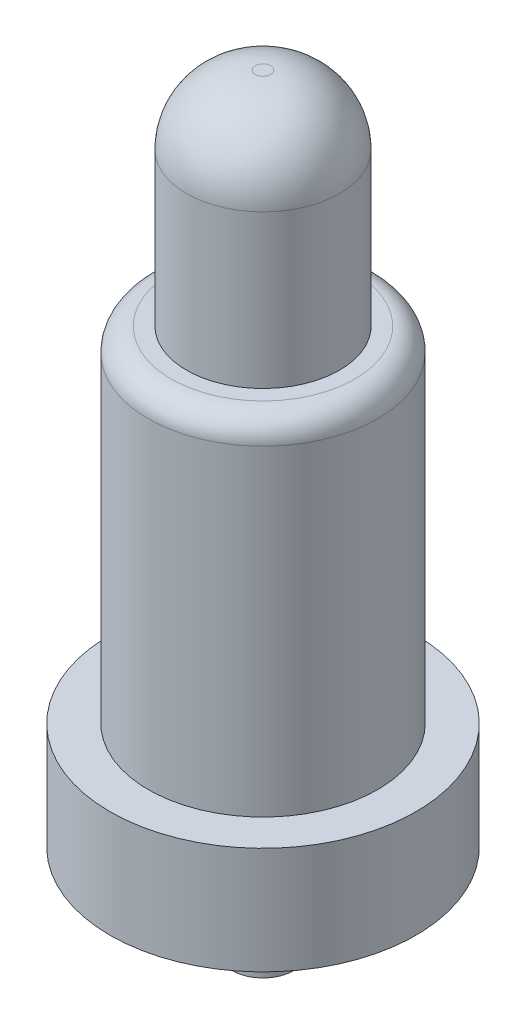
ISO-10303-21;
HEADER;
FILE_DESCRIPTION(('STEP AP214'),'2;1');
FILE_NAME('part.step','',(''),(''),'','','');
FILE_SCHEMA(('AUTOMOTIVE_DESIGN { 1 0 10303 214 1 1 1 1 }'));
ENDSEC;
DATA;
#1=APPLICATION_CONTEXT('core data for automotive mechanical design processes');
#2=APPLICATION_PROTOCOL_DEFINITION('international standard','automotive_design',2000,#1);
#3=PRODUCT_CONTEXT('',#1,'mechanical');
#4=PRODUCT('Part','Part','',(#3));
#5=PRODUCT_RELATED_PRODUCT_CATEGORY('part','',(#4));
#6=PRODUCT_DEFINITION_FORMATION('','',#4);
#7=PRODUCT_DEFINITION_CONTEXT('part definition',#1,'design');
#8=PRODUCT_DEFINITION('design','',#6,#7);
#9=PRODUCT_DEFINITION_SHAPE('','',#8);
#10=(LENGTH_UNIT() NAMED_UNIT(*) SI_UNIT(.MILLI.,.METRE.));
#11=(NAMED_UNIT(*) PLANE_ANGLE_UNIT() SI_UNIT($,.RADIAN.));
#12=(NAMED_UNIT(*) SI_UNIT($,.STERADIAN.) SOLID_ANGLE_UNIT());
#13=UNCERTAINTY_MEASURE_WITH_UNIT(LENGTH_MEASURE(1.E-05),#10,'distance_accuracy_value','');
#14=(GEOMETRIC_REPRESENTATION_CONTEXT(3) GLOBAL_UNCERTAINTY_ASSIGNED_CONTEXT((#13)) GLOBAL_UNIT_ASSIGNED_CONTEXT((#10,
#11,#12)) REPRESENTATION_CONTEXT('',''));
#15=CARTESIAN_POINT('',(0.,0.,0.));
#16=DIRECTION('',(0.,0.,1.));
#17=DIRECTION('',(1.,0.,0.));
#18=AXIS2_PLACEMENT_3D('',#15,#16,#17);
#19=CARTESIAN_POINT('',(0.,0.,0.));
#20=DIRECTION('',(0.,1.,0.));
#21=DIRECTION('',(0.,0.,1.));
#22=AXIS2_PLACEMENT_3D('',#19,#20,#21);
#23=PLANE('',#22);
#24=CARTESIAN_POINT('',(0.,0.,0.));
#25=DIRECTION('',(0.,-1.,0.));
#26=DIRECTION('',(0.,0.,-1.));
#27=AXIS2_PLACEMENT_3D('',#24,#25,#26);
#28=CIRCLE('',#27,0.2);
#29=CARTESIAN_POINT('',(0.,0.,-0.2));
#30=VERTEX_POINT('',#29);
#31=EDGE_CURVE('E10',#30,#30,#28,.T.);
#32=ORIENTED_EDGE('',*,*,#31,.T.);
#33=EDGE_LOOP('',(#32));
#34=FACE_BOUND('',#33,.T.);
#35=ADVANCED_FACE('F37',(#34),#23,.F.);
#36=CARTESIAN_POINT('',(0.,0.,0.));
#37=DIRECTION('',(0.,-1.,0.));
#38=DIRECTION('',(0.,0.,-1.));
#39=AXIS2_PLACEMENT_3D('',#36,#37,#38);
#40=CYLINDRICAL_SURFACE('',#39,0.2);
#41=ORIENTED_EDGE('',*,*,#31,.F.);
#42=EDGE_LOOP('',(#41));
#43=FACE_BOUND('',#42,.T.);
#44=CARTESIAN_POINT('',(0.,0.6,0.));
#45=DIRECTION('',(0.,-1.,0.));
#46=DIRECTION('',(0.,0.,-1.));
#47=AXIS2_PLACEMENT_3D('',#44,#45,#46);
#48=CIRCLE('',#47,0.2);
#49=CARTESIAN_POINT('',(0.,0.6,-0.2));
#50=VERTEX_POINT('',#49);
#51=EDGE_CURVE('E44',#50,#50,#48,.T.);
#52=ORIENTED_EDGE('',*,*,#51,.T.);
#53=EDGE_LOOP('',(#52));
#54=FACE_BOUND('',#53,.T.);
#55=ADVANCED_FACE('F97',(#43,#54),#40,.T.);
#56=CARTESIAN_POINT('',(-0.2,0.6,0.));
#57=DIRECTION('',(0.,1.,0.));
#58=DIRECTION('',(0.,0.,1.));
#59=AXIS2_PLACEMENT_3D('',#56,#57,#58);
#60=PLANE('',#59);
#61=ORIENTED_EDGE('',*,*,#51,.F.);
#62=EDGE_LOOP('',(#61));
#63=FACE_BOUND('',#62,.T.);
#64=CARTESIAN_POINT('',(0.,0.6,0.));
#65=DIRECTION('',(0.,-1.,0.));
#66=DIRECTION('',(0.,0.,-1.));
#67=AXIS2_PLACEMENT_3D('',#64,#65,#66);
#68=CIRCLE('',#67,1.);
#69=CARTESIAN_POINT('',(0.,0.6,-1.));
#70=VERTEX_POINT('',#69);
#71=EDGE_CURVE('E49',#70,#70,#68,.T.);
#72=ORIENTED_EDGE('',*,*,#71,.T.);
#73=EDGE_LOOP('',(#72));
#74=FACE_BOUND('',#73,.T.);
#75=ADVANCED_FACE('F101',(#63,#74),#60,.F.);
#76=CARTESIAN_POINT('',(0.,0.,0.));
#77=DIRECTION('',(0.,-1.,0.));
#78=DIRECTION('',(0.,0.,-1.));
#79=AXIS2_PLACEMENT_3D('',#76,#77,#78);
#80=CYLINDRICAL_SURFACE('',#79,1.);
#81=ORIENTED_EDGE('',*,*,#71,.F.);
#82=EDGE_LOOP('',(#81));
#83=FACE_BOUND('',#82,.T.);
#84=CARTESIAN_POINT('',(0.,1.3,0.));
#85=DIRECTION('',(0.,-1.,0.));
#86=DIRECTION('',(0.,0.,-1.));
#87=AXIS2_PLACEMENT_3D('',#84,#85,#86);
#88=CIRCLE('',#87,1.);
#89=CARTESIAN_POINT('',(0.,1.3,-1.));
#90=VERTEX_POINT('',#89);
#91=EDGE_CURVE('E54',#90,#90,#88,.T.);
#92=ORIENTED_EDGE('',*,*,#91,.T.);
#93=EDGE_LOOP('',(#92));
#94=FACE_BOUND('',#93,.T.);
#95=ADVANCED_FACE('F106',(#83,#94),#80,.T.);
#96=CARTESIAN_POINT('',(-1.,1.3,0.));
#97=DIRECTION('',(0.,-1.,0.));
#98=DIRECTION('',(0.,0.,-1.));
#99=AXIS2_PLACEMENT_3D('',#96,#97,#98);
#100=PLANE('',#99);
#101=ORIENTED_EDGE('',*,*,#91,.F.);
#102=EDGE_LOOP('',(#101));
#103=FACE_BOUND('',#102,.T.);
#104=CARTESIAN_POINT('',(0.,1.3,0.));
#105=DIRECTION('',(0.,-1.,0.));
#106=DIRECTION('',(0.,0.,-1.));
#107=AXIS2_PLACEMENT_3D('',#104,#105,#106);
#108=CIRCLE('',#107,0.75);
#109=CARTESIAN_POINT('',(0.,1.3,-0.75));
#110=VERTEX_POINT('',#109);
#111=EDGE_CURVE('E60',#110,#110,#108,.T.);
#112=ORIENTED_EDGE('',*,*,#111,.T.);
#113=EDGE_LOOP('',(#112));
#114=FACE_BOUND('',#113,.T.);
#115=ADVANCED_FACE('F112',(#103,#114),#100,.F.);
#116=CARTESIAN_POINT('',(0.,0.,0.));
#117=DIRECTION('',(0.,-1.,0.));
#118=DIRECTION('',(0.,0.,-1.));
#119=AXIS2_PLACEMENT_3D('',#116,#117,#118);
#120=CYLINDRICAL_SURFACE('',#119,0.75);
#121=ORIENTED_EDGE('',*,*,#111,.F.);
#122=EDGE_LOOP('',(#121));
#123=FACE_BOUND('',#122,.T.);
#124=CARTESIAN_POINT('',(0.,3.4,0.));
#125=DIRECTION('',(0.,-1.,0.));
#126=DIRECTION('',(0.,0.,-1.));
#127=AXIS2_PLACEMENT_3D('',#124,#125,#126);
#128=CIRCLE('',#127,0.75);
#129=CARTESIAN_POINT('',(0.,3.4,-0.75));
#130=VERTEX_POINT('',#129);
#131=EDGE_CURVE('E64',#130,#130,#128,.T.);
#132=ORIENTED_EDGE('',*,*,#131,.T.);
#133=EDGE_LOOP('',(#132));
#134=FACE_BOUND('',#133,.T.);
#135=ADVANCED_FACE('F116',(#123,#134),#120,.T.);
#136=CARTESIAN_POINT('',(0.,3.4,0.));
#137=DIRECTION('',(0.,-1.,0.));
#138=DIRECTION('',(0.,0.,-1.));
#139=AXIS2_PLACEMENT_3D('',#136,#137,#138);
#140=TOROIDAL_SURFACE('',#139,0.6,0.15);
#141=ORIENTED_EDGE('',*,*,#131,.F.);
#142=EDGE_LOOP('',(#141));
#143=FACE_BOUND('',#142,.T.);
#144=CARTESIAN_POINT('',(0.,3.55,0.));
#145=DIRECTION('',(0.,-1.,0.));
#146=DIRECTION('',(0.,0.,-1.));
#147=AXIS2_PLACEMENT_3D('',#144,#145,#146);
#148=CIRCLE('',#147,0.599999999999999);
#149=CARTESIAN_POINT('',(0.,3.55,-0.599999999999999));
#150=VERTEX_POINT('',#149);
#151=EDGE_CURVE('E68',#150,#150,#148,.T.);
#152=ORIENTED_EDGE('',*,*,#151,.T.);
#153=EDGE_LOOP('',(#152));
#154=FACE_BOUND('',#153,.T.);
#155=ADVANCED_FACE('F120',(#143,#154),#140,.T.);
#156=CARTESIAN_POINT('',(-0.599999999999999,3.55,0.));
#157=DIRECTION('',(0.,-1.,0.));
#158=DIRECTION('',(0.,0.,-1.));
#159=AXIS2_PLACEMENT_3D('',#156,#157,#158);
#160=PLANE('',#159);
#161=ORIENTED_EDGE('',*,*,#151,.F.);
#162=EDGE_LOOP('',(#161));
#163=FACE_BOUND('',#162,.T.);
#164=CARTESIAN_POINT('',(0.,3.55,0.));
#165=DIRECTION('',(0.,-1.,0.));
#166=DIRECTION('',(0.,0.,-1.));
#167=AXIS2_PLACEMENT_3D('',#164,#165,#166);
#168=CIRCLE('',#167,0.5);
#169=CARTESIAN_POINT('',(0.,3.55,-0.5));
#170=VERTEX_POINT('',#169);
#171=EDGE_CURVE('E72',#170,#170,#168,.T.);
#172=ORIENTED_EDGE('',*,*,#171,.T.);
#173=EDGE_LOOP('',(#172));
#174=FACE_BOUND('',#173,.T.);
#175=ADVANCED_FACE('F124',(#163,#174),#160,.F.);
#176=CARTESIAN_POINT('',(0.,0.,0.));
#177=DIRECTION('',(0.,-1.,0.));
#178=DIRECTION('',(0.,0.,-1.));
#179=AXIS2_PLACEMENT_3D('',#176,#177,#178);
#180=CYLINDRICAL_SURFACE('',#179,0.5);
#181=ORIENTED_EDGE('',*,*,#171,.F.);
#182=EDGE_LOOP('',(#181));
#183=FACE_BOUND('',#182,.T.);
#184=CARTESIAN_POINT('',(0.,4.55,0.));
#185=DIRECTION('',(0.,-1.,0.));
#186=DIRECTION('',(0.,0.,-1.));
#187=AXIS2_PLACEMENT_3D('',#184,#185,#186);
#188=CIRCLE('',#187,0.5);
#189=CARTESIAN_POINT('',(0.,4.55,-0.5));
#190=VERTEX_POINT('',#189);
#191=EDGE_CURVE('E76',#190,#190,#188,.T.);
#192=ORIENTED_EDGE('',*,*,#191,.T.);
#193=EDGE_LOOP('',(#192));
#194=FACE_BOUND('',#193,.T.);
#195=ADVANCED_FACE('F93',(#183,#194),#180,.T.);
#196=CARTESIAN_POINT('',(0.,4.55,0.));
#197=DIRECTION('',(0.,-1.,0.));
#198=DIRECTION('',(0.,0.,-1.));
#199=AXIS2_PLACEMENT_3D('',#196,#197,#198);
#200=DEGENERATE_TOROIDAL_SURFACE('',#199,0.0500000000000001,0.45,.T.);
#201=ORIENTED_EDGE('',*,*,#191,.F.);
#202=EDGE_LOOP('',(#201));
#203=FACE_BOUND('',#202,.T.);
#204=CARTESIAN_POINT('',(0.,5.,0.));
#205=DIRECTION('',(0.,-1.,0.));
#206=DIRECTION('',(0.,0.,-1.));
#207=AXIS2_PLACEMENT_3D('',#204,#205,#206);
#208=CIRCLE('',#207,0.049999999999997);
#209=CARTESIAN_POINT('',(0.,5.,-0.049999999999997));
#210=VERTEX_POINT('',#209);
#211=EDGE_CURVE('E80',#210,#210,#208,.T.);
#212=ORIENTED_EDGE('',*,*,#211,.T.);
#213=EDGE_LOOP('',(#212));
#214=FACE_BOUND('',#213,.T.);
#215=ADVANCED_FACE('F85',(#203,#214),#200,.T.);
#216=CARTESIAN_POINT('',(-0.0499999999999968,5.,0.));
#217=DIRECTION('',(0.,-1.,0.));
#218=DIRECTION('',(0.,0.,-1.));
#219=AXIS2_PLACEMENT_3D('',#216,#217,#218);
#220=PLANE('',#219);
#221=ORIENTED_EDGE('',*,*,#211,.F.);
#222=EDGE_LOOP('',(#221));
#223=FACE_BOUND('',#222,.T.);
#224=ADVANCED_FACE('F87',(#223),#220,.F.);
#225=CLOSED_SHELL('',(#35,#55,#75,#95,#115,#135,#155,#175,#195,#215,#224));
#226=MANIFOLD_SOLID_BREP('B2',#225);
#227=ADVANCED_BREP_SHAPE_REPRESENTATION('',(#18,#226),#14);
#228=SHAPE_DEFINITION_REPRESENTATION(#9,#227);
ENDSEC;
END-ISO-10303-21;
